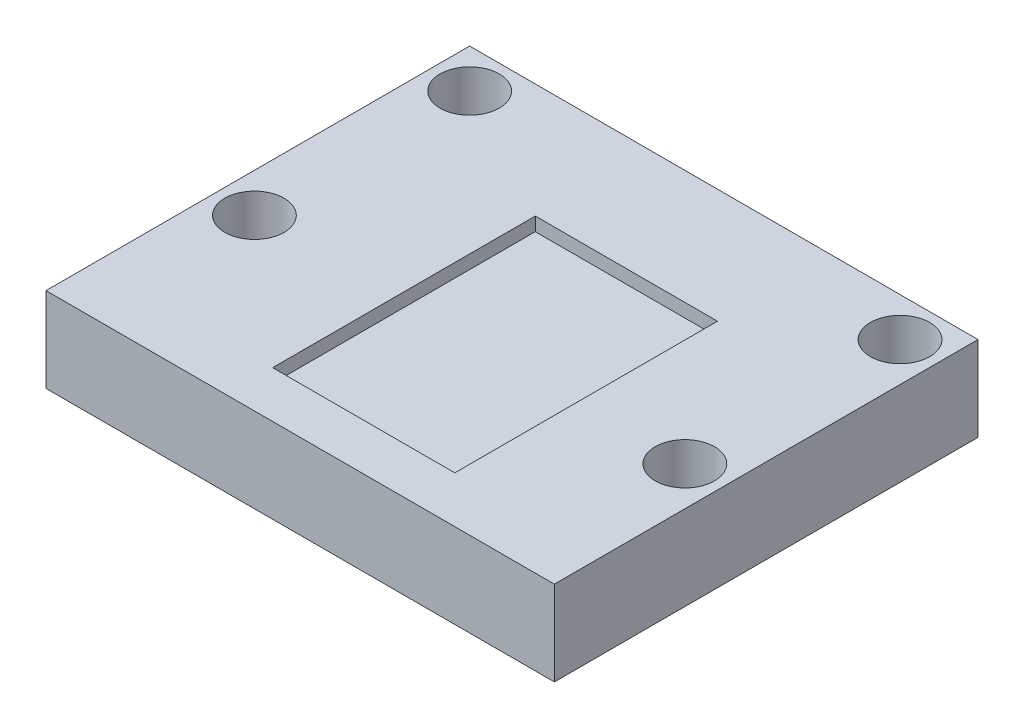
ISO-10303-21;
HEADER;
FILE_DESCRIPTION(('STEP AP214'),'2;1');
FILE_NAME('part.step','',(''),(''),'','','');
FILE_SCHEMA(('AUTOMOTIVE_DESIGN { 1 0 10303 214 1 1 1 1 }'));
ENDSEC;
DATA;
#1=APPLICATION_CONTEXT('core data for automotive mechanical design processes');
#2=APPLICATION_PROTOCOL_DEFINITION('international standard','automotive_design',2000,#1);
#3=PRODUCT_CONTEXT('',#1,'mechanical');
#4=PRODUCT('Part','Part','',(#3));
#5=PRODUCT_RELATED_PRODUCT_CATEGORY('part','',(#4));
#6=PRODUCT_DEFINITION_FORMATION('','',#4);
#7=PRODUCT_DEFINITION_CONTEXT('part definition',#1,'design');
#8=PRODUCT_DEFINITION('design','',#6,#7);
#9=PRODUCT_DEFINITION_SHAPE('','',#8);
#10=(LENGTH_UNIT() NAMED_UNIT(*) SI_UNIT(.MILLI.,.METRE.));
#11=(NAMED_UNIT(*) PLANE_ANGLE_UNIT() SI_UNIT($,.RADIAN.));
#12=(NAMED_UNIT(*) SI_UNIT($,.STERADIAN.) SOLID_ANGLE_UNIT());
#13=UNCERTAINTY_MEASURE_WITH_UNIT(LENGTH_MEASURE(1.E-05),#10,'distance_accuracy_value','');
#14=(GEOMETRIC_REPRESENTATION_CONTEXT(3) GLOBAL_UNCERTAINTY_ASSIGNED_CONTEXT((#13)) GLOBAL_UNIT_ASSIGNED_CONTEXT((#10,
#11,#12)) REPRESENTATION_CONTEXT('',''));
#15=CARTESIAN_POINT('',(0.,0.,0.));
#16=DIRECTION('',(0.,0.,1.));
#17=DIRECTION('',(1.,0.,0.));
#18=AXIS2_PLACEMENT_3D('',#15,#16,#17);
#19=CARTESIAN_POINT('',(0.,10.,0.));
#20=DIRECTION('',(1.,0.,0.));
#21=DIRECTION('',(0.,0.,-1.));
#22=AXIS2_PLACEMENT_3D('',#19,#20,#21);
#23=PLANE('',#22);
#24=DIRECTION('',(0.,0.,1.));
#25=VECTOR('',#24,1.);
#26=CARTESIAN_POINT('',(0.,0.,0.));
#27=LINE('',#26,#25);
#28=CARTESIAN_POINT('',(0.,0.,-50.));
#29=VERTEX_POINT('',#28);
#30=CARTESIAN_POINT('',(0.,0.,0.));
#31=VERTEX_POINT('',#30);
#32=EDGE_CURVE('E200',#29,#31,#27,.T.);
#33=ORIENTED_EDGE('',*,*,#32,.T.);
#34=DIRECTION('',(0.,-1.,0.));
#35=VECTOR('',#34,1.);
#36=CARTESIAN_POINT('',(0.,10.,0.));
#37=LINE('',#36,#35);
#38=CARTESIAN_POINT('',(0.,10.,0.));
#39=VERTEX_POINT('',#38);
#40=EDGE_CURVE('E11',#39,#31,#37,.T.);
#41=ORIENTED_EDGE('',*,*,#40,.F.);
#42=DIRECTION('',(0.,0.,1.));
#43=VECTOR('',#42,1.);
#44=CARTESIAN_POINT('',(0.,10.,0.));
#45=LINE('',#44,#43);
#46=CARTESIAN_POINT('',(0.,10.,-50.));
#47=VERTEX_POINT('',#46);
#48=EDGE_CURVE('E204',#47,#39,#45,.T.);
#49=ORIENTED_EDGE('',*,*,#48,.F.);
#50=DIRECTION('',(0.,-1.,0.));
#51=VECTOR('',#50,1.);
#52=CARTESIAN_POINT('',(0.,10.,-50.));
#53=LINE('',#52,#51);
#54=EDGE_CURVE('E214',#47,#29,#53,.T.);
#55=ORIENTED_EDGE('',*,*,#54,.T.);
#56=EDGE_LOOP('',(#33,#41,#49,#55));
#57=FACE_BOUND('',#56,.T.);
#58=ADVANCED_FACE('F47',(#57),#23,.F.);
#59=CARTESIAN_POINT('',(0.,10.,0.));
#60=DIRECTION('',(0.,0.,-1.));
#61=DIRECTION('',(-1.,0.,0.));
#62=AXIS2_PLACEMENT_3D('',#59,#60,#61);
#63=PLANE('',#62);
#64=DIRECTION('',(1.,0.,0.));
#65=VECTOR('',#64,1.);
#66=CARTESIAN_POINT('',(0.,0.,0.));
#67=LINE('',#66,#65);
#68=CARTESIAN_POINT('',(60.,0.,0.));
#69=VERTEX_POINT('',#68);
#70=EDGE_CURVE('E218',#31,#69,#67,.T.);
#71=ORIENTED_EDGE('',*,*,#70,.T.);
#72=DIRECTION('',(0.,-1.,0.));
#73=VECTOR('',#72,1.);
#74=CARTESIAN_POINT('',(60.,10.,0.));
#75=LINE('',#74,#73);
#76=CARTESIAN_POINT('',(60.,10.,0.));
#77=VERTEX_POINT('',#76);
#78=EDGE_CURVE('E55',#77,#69,#75,.T.);
#79=ORIENTED_EDGE('',*,*,#78,.F.);
#80=DIRECTION('',(1.,0.,0.));
#81=VECTOR('',#80,1.);
#82=CARTESIAN_POINT('',(0.,10.,0.));
#83=LINE('',#82,#81);
#84=EDGE_CURVE('E99',#39,#77,#83,.T.);
#85=ORIENTED_EDGE('',*,*,#84,.F.);
#86=ORIENTED_EDGE('',*,*,#40,.T.);
#87=EDGE_LOOP('',(#71,#79,#85,#86));
#88=FACE_BOUND('',#87,.T.);
#89=ADVANCED_FACE('F254',(#88),#63,.F.);
#90=CARTESIAN_POINT('',(60.,10.,0.));
#91=DIRECTION('',(-1.,0.,0.));
#92=DIRECTION('',(0.,0.,1.));
#93=AXIS2_PLACEMENT_3D('',#90,#91,#92);
#94=PLANE('',#93);
#95=DIRECTION('',(0.,0.,-1.));
#96=VECTOR('',#95,1.);
#97=CARTESIAN_POINT('',(60.,0.,0.));
#98=LINE('',#97,#96);
#99=CARTESIAN_POINT('',(60.,0.,-50.));
#100=VERTEX_POINT('',#99);
#101=EDGE_CURVE('E221',#69,#100,#98,.T.);
#102=ORIENTED_EDGE('',*,*,#101,.T.);
#103=DIRECTION('',(0.,-1.,0.));
#104=VECTOR('',#103,1.);
#105=CARTESIAN_POINT('',(60.,10.,-50.));
#106=LINE('',#105,#104);
#107=CARTESIAN_POINT('',(60.,10.,-50.));
#108=VERTEX_POINT('',#107);
#109=EDGE_CURVE('E228',#108,#100,#106,.T.);
#110=ORIENTED_EDGE('',*,*,#109,.F.);
#111=DIRECTION('',(0.,0.,-1.));
#112=VECTOR('',#111,1.);
#113=CARTESIAN_POINT('',(60.,10.,0.));
#114=LINE('',#113,#112);
#115=EDGE_CURVE('E209',#77,#108,#114,.T.);
#116=ORIENTED_EDGE('',*,*,#115,.F.);
#117=ORIENTED_EDGE('',*,*,#78,.T.);
#118=EDGE_LOOP('',(#102,#110,#116,#117));
#119=FACE_BOUND('',#118,.T.);
#120=ADVANCED_FACE('F235',(#119),#94,.F.);
#121=CARTESIAN_POINT('',(0.,10.,-50.));
#122=DIRECTION('',(0.,0.,1.));
#123=DIRECTION('',(1.,0.,0.));
#124=AXIS2_PLACEMENT_3D('',#121,#122,#123);
#125=PLANE('',#124);
#126=DIRECTION('',(-1.,0.,0.));
#127=VECTOR('',#126,1.);
#128=CARTESIAN_POINT('',(0.,0.,-50.));
#129=LINE('',#128,#127);
#130=EDGE_CURVE('E92',#100,#29,#129,.T.);
#131=ORIENTED_EDGE('',*,*,#130,.T.);
#132=ORIENTED_EDGE('',*,*,#54,.F.);
#133=DIRECTION('',(-1.,0.,0.));
#134=VECTOR('',#133,1.);
#135=CARTESIAN_POINT('',(0.,10.,-50.));
#136=LINE('',#135,#134);
#137=EDGE_CURVE('E71',#108,#47,#136,.T.);
#138=ORIENTED_EDGE('',*,*,#137,.F.);
#139=ORIENTED_EDGE('',*,*,#109,.T.);
#140=EDGE_LOOP('',(#131,#132,#138,#139));
#141=FACE_BOUND('',#140,.T.);
#142=ADVANCED_FACE('F243',(#141),#125,.F.);
#143=CARTESIAN_POINT('',(0.,10.,0.));
#144=DIRECTION('',(0.,-1.,0.));
#145=DIRECTION('',(0.,0.,-1.));
#146=AXIS2_PLACEMENT_3D('',#143,#144,#145);
#147=PLANE('',#146);
#148=DIRECTION('',(1.,0.,0.));
#149=VECTOR('',#148,1.);
#150=CARTESIAN_POINT('',(21.25,10.,-5.50000000000002));
#151=LINE('',#150,#149);
#152=CARTESIAN_POINT('',(21.25,10.,-5.50000000000002));
#153=VERTEX_POINT('',#152);
#154=CARTESIAN_POINT('',(42.75,10.,-5.50000000000001));
#155=VERTEX_POINT('',#154);
#156=EDGE_CURVE('E157',#153,#155,#151,.T.);
#157=ORIENTED_EDGE('',*,*,#156,.F.);
#158=DIRECTION('',(0.,0.,1.));
#159=VECTOR('',#158,1.);
#160=CARTESIAN_POINT('',(21.25,10.,-36.5));
#161=LINE('',#160,#159);
#162=CARTESIAN_POINT('',(21.25,10.,-36.5));
#163=VERTEX_POINT('',#162);
#164=EDGE_CURVE('E62',#163,#153,#161,.T.);
#165=ORIENTED_EDGE('',*,*,#164,.F.);
#166=DIRECTION('',(-1.,0.,0.));
#167=VECTOR('',#166,1.);
#168=CARTESIAN_POINT('',(21.25,10.,-36.5));
#169=LINE('',#168,#167);
#170=CARTESIAN_POINT('',(42.75,10.,-36.5));
#171=VERTEX_POINT('',#170);
#172=EDGE_CURVE('E144',#171,#163,#169,.T.);
#173=ORIENTED_EDGE('',*,*,#172,.F.);
#174=DIRECTION('',(0.,0.,-1.));
#175=VECTOR('',#174,1.);
#176=CARTESIAN_POINT('',(42.75,10.,-36.5));
#177=LINE('',#176,#175);
#178=EDGE_CURVE('E148',#155,#171,#177,.T.);
#179=ORIENTED_EDGE('',*,*,#178,.F.);
#180=EDGE_LOOP('',(#157,#165,#173,#179));
#181=FACE_BOUND('',#180,.T.);
#182=CARTESIAN_POINT('',(55.4,10.,-45.4));
#183=DIRECTION('',(0.,1.,0.));
#184=DIRECTION('',(0.,0.,1.));
#185=AXIS2_PLACEMENT_3D('',#182,#183,#184);
#186=CIRCLE('',#185,3.5);
#187=CARTESIAN_POINT('',(55.4,10.,-41.9));
#188=VERTEX_POINT('',#187);
#189=EDGE_CURVE('E185',#188,#188,#186,.T.);
#190=ORIENTED_EDGE('',*,*,#189,.F.);
#191=EDGE_LOOP('',(#190));
#192=FACE_BOUND('',#191,.T.);
#193=CARTESIAN_POINT('',(4.6,10.,-20.));
#194=DIRECTION('',(0.,1.,0.));
#195=DIRECTION('',(0.,0.,1.));
#196=AXIS2_PLACEMENT_3D('',#193,#194,#195);
#197=CIRCLE('',#196,3.5);
#198=CARTESIAN_POINT('',(4.6,10.,-16.5));
#199=VERTEX_POINT('',#198);
#200=EDGE_CURVE('E176',#199,#199,#197,.T.);
#201=ORIENTED_EDGE('',*,*,#200,.F.);
#202=EDGE_LOOP('',(#201));
#203=FACE_BOUND('',#202,.T.);
#204=CARTESIAN_POINT('',(55.4,10.,-20.));
#205=DIRECTION('',(0.,1.,0.));
#206=DIRECTION('',(0.,0.,1.));
#207=AXIS2_PLACEMENT_3D('',#204,#205,#206);
#208=CIRCLE('',#207,3.5);
#209=CARTESIAN_POINT('',(55.4,10.,-16.5));
#210=VERTEX_POINT('',#209);
#211=EDGE_CURVE('E166',#210,#210,#208,.T.);
#212=ORIENTED_EDGE('',*,*,#211,.F.);
#213=EDGE_LOOP('',(#212));
#214=FACE_BOUND('',#213,.T.);
#215=CARTESIAN_POINT('',(4.6,10.,-45.4));
#216=DIRECTION('',(0.,1.,0.));
#217=DIRECTION('',(0.,0.,1.));
#218=AXIS2_PLACEMENT_3D('',#215,#216,#217);
#219=CIRCLE('',#218,3.50000000000001);
#220=CARTESIAN_POINT('',(4.6,10.,-41.9));
#221=VERTEX_POINT('',#220);
#222=EDGE_CURVE('E184',#221,#221,#219,.T.);
#223=ORIENTED_EDGE('',*,*,#222,.F.);
#224=EDGE_LOOP('',(#223));
#225=FACE_BOUND('',#224,.T.);
#226=ORIENTED_EDGE('',*,*,#48,.T.);
#227=ORIENTED_EDGE('',*,*,#84,.T.);
#228=ORIENTED_EDGE('',*,*,#115,.T.);
#229=ORIENTED_EDGE('',*,*,#137,.T.);
#230=EDGE_LOOP('',(#226,#227,#228,#229));
#231=FACE_BOUND('',#230,.T.);
#232=ADVANCED_FACE('F245',(#181,#192,#203,#214,#225,#231),#147,.F.);
#233=CARTESIAN_POINT('',(0.,0.,0.));
#234=DIRECTION('',(0.,-1.,0.));
#235=DIRECTION('',(0.,0.,-1.));
#236=AXIS2_PLACEMENT_3D('',#233,#234,#235);
#237=PLANE('',#236);
#238=CARTESIAN_POINT('',(55.4,0.,-45.4));
#239=DIRECTION('',(0.,1.,0.));
#240=DIRECTION('',(0.,0.,1.));
#241=AXIS2_PLACEMENT_3D('',#238,#239,#240);
#242=CIRCLE('',#241,3.5);
#243=CARTESIAN_POINT('',(55.4,0.,-41.9));
#244=VERTEX_POINT('',#243);
#245=EDGE_CURVE('E180',#244,#244,#242,.T.);
#246=ORIENTED_EDGE('',*,*,#245,.T.);
#247=EDGE_LOOP('',(#246));
#248=FACE_BOUND('',#247,.T.);
#249=CARTESIAN_POINT('',(4.6,0.,-20.));
#250=DIRECTION('',(0.,1.,0.));
#251=DIRECTION('',(0.,0.,1.));
#252=AXIS2_PLACEMENT_3D('',#249,#250,#251);
#253=CIRCLE('',#252,3.5);
#254=CARTESIAN_POINT('',(4.6,0.,-16.5));
#255=VERTEX_POINT('',#254);
#256=EDGE_CURVE('E189',#255,#255,#253,.T.);
#257=ORIENTED_EDGE('',*,*,#256,.T.);
#258=EDGE_LOOP('',(#257));
#259=FACE_BOUND('',#258,.T.);
#260=CARTESIAN_POINT('',(55.4,0.,-20.));
#261=DIRECTION('',(0.,1.,0.));
#262=DIRECTION('',(0.,0.,1.));
#263=AXIS2_PLACEMENT_3D('',#260,#261,#262);
#264=CIRCLE('',#263,3.5);
#265=CARTESIAN_POINT('',(55.4,0.,-16.5));
#266=VERTEX_POINT('',#265);
#267=EDGE_CURVE('E172',#266,#266,#264,.T.);
#268=ORIENTED_EDGE('',*,*,#267,.T.);
#269=EDGE_LOOP('',(#268));
#270=FACE_BOUND('',#269,.T.);
#271=CARTESIAN_POINT('',(4.6,0.,-45.4));
#272=DIRECTION('',(0.,1.,0.));
#273=DIRECTION('',(0.,0.,1.));
#274=AXIS2_PLACEMENT_3D('',#271,#272,#273);
#275=CIRCLE('',#274,3.50000000000001);
#276=CARTESIAN_POINT('',(4.6,0.,-41.9));
#277=VERTEX_POINT('',#276);
#278=EDGE_CURVE('E196',#277,#277,#275,.T.);
#279=ORIENTED_EDGE('',*,*,#278,.T.);
#280=EDGE_LOOP('',(#279));
#281=FACE_BOUND('',#280,.T.);
#282=ORIENTED_EDGE('',*,*,#32,.F.);
#283=ORIENTED_EDGE('',*,*,#130,.F.);
#284=ORIENTED_EDGE('',*,*,#101,.F.);
#285=ORIENTED_EDGE('',*,*,#70,.F.);
#286=EDGE_LOOP('',(#282,#283,#284,#285));
#287=FACE_BOUND('',#286,.T.);
#288=ADVANCED_FACE('F239',(#248,#259,#270,#281,#287),#237,.T.);
#289=CARTESIAN_POINT('',(4.6,0.,-45.4));
#290=DIRECTION('',(0.,1.,0.));
#291=DIRECTION('',(0.,0.,1.));
#292=AXIS2_PLACEMENT_3D('',#289,#290,#291);
#293=CYLINDRICAL_SURFACE('',#292,3.50000000000001);
#294=ORIENTED_EDGE('',*,*,#278,.F.);
#295=EDGE_LOOP('',(#294));
#296=FACE_BOUND('',#295,.T.);
#297=ORIENTED_EDGE('',*,*,#222,.T.);
#298=EDGE_LOOP('',(#297));
#299=FACE_BOUND('',#298,.T.);
#300=ADVANCED_FACE('F289',(#296,#299),#293,.F.);
#301=CARTESIAN_POINT('',(55.4,0.,-20.));
#302=DIRECTION('',(0.,1.,0.));
#303=DIRECTION('',(0.,0.,1.));
#304=AXIS2_PLACEMENT_3D('',#301,#302,#303);
#305=CYLINDRICAL_SURFACE('',#304,3.5);
#306=ORIENTED_EDGE('',*,*,#267,.F.);
#307=EDGE_LOOP('',(#306));
#308=FACE_BOUND('',#307,.T.);
#309=ORIENTED_EDGE('',*,*,#211,.T.);
#310=EDGE_LOOP('',(#309));
#311=FACE_BOUND('',#310,.T.);
#312=ADVANCED_FACE('F298',(#308,#311),#305,.F.);
#313=CARTESIAN_POINT('',(4.6,0.,-20.));
#314=DIRECTION('',(0.,1.,0.));
#315=DIRECTION('',(0.,0.,1.));
#316=AXIS2_PLACEMENT_3D('',#313,#314,#315);
#317=CYLINDRICAL_SURFACE('',#316,3.5);
#318=ORIENTED_EDGE('',*,*,#256,.F.);
#319=EDGE_LOOP('',(#318));
#320=FACE_BOUND('',#319,.T.);
#321=ORIENTED_EDGE('',*,*,#200,.T.);
#322=EDGE_LOOP('',(#321));
#323=FACE_BOUND('',#322,.T.);
#324=ADVANCED_FACE('F308',(#320,#323),#317,.F.);
#325=CARTESIAN_POINT('',(55.4,0.,-45.4));
#326=DIRECTION('',(0.,1.,0.));
#327=DIRECTION('',(0.,0.,1.));
#328=AXIS2_PLACEMENT_3D('',#325,#326,#327);
#329=CYLINDRICAL_SURFACE('',#328,3.5);
#330=ORIENTED_EDGE('',*,*,#245,.F.);
#331=EDGE_LOOP('',(#330));
#332=FACE_BOUND('',#331,.T.);
#333=ORIENTED_EDGE('',*,*,#189,.T.);
#334=EDGE_LOOP('',(#333));
#335=FACE_BOUND('',#334,.T.);
#336=ADVANCED_FACE('F318',(#332,#335),#329,.F.);
#337=CARTESIAN_POINT('',(21.25,8.4,-36.5));
#338=DIRECTION('',(-1.,0.,0.));
#339=DIRECTION('',(0.,0.,1.));
#340=AXIS2_PLACEMENT_3D('',#337,#338,#339);
#341=PLANE('',#340);
#342=ORIENTED_EDGE('',*,*,#164,.T.);
#343=DIRECTION('',(0.,1.,0.));
#344=VECTOR('',#343,1.);
#345=CARTESIAN_POINT('',(21.25,8.4,-5.50000000000002));
#346=LINE('',#345,#344);
#347=CARTESIAN_POINT('',(21.25,8.4,-5.50000000000002));
#348=VERTEX_POINT('',#347);
#349=EDGE_CURVE('E119',#348,#153,#346,.T.);
#350=ORIENTED_EDGE('',*,*,#349,.F.);
#351=DIRECTION('',(0.,0.,1.));
#352=VECTOR('',#351,1.);
#353=CARTESIAN_POINT('',(21.25,8.4,-36.5));
#354=LINE('',#353,#352);
#355=CARTESIAN_POINT('',(21.25,8.4,-36.5));
#356=VERTEX_POINT('',#355);
#357=EDGE_CURVE('E123',#356,#348,#354,.T.);
#358=ORIENTED_EDGE('',*,*,#357,.F.);
#359=DIRECTION('',(0.,1.,0.));
#360=VECTOR('',#359,1.);
#361=CARTESIAN_POINT('',(21.25,8.4,-36.5));
#362=LINE('',#361,#360);
#363=EDGE_CURVE('E163',#356,#163,#362,.T.);
#364=ORIENTED_EDGE('',*,*,#363,.T.);
#365=EDGE_LOOP('',(#342,#350,#358,#364));
#366=FACE_BOUND('',#365,.T.);
#367=ADVANCED_FACE('F121',(#366),#341,.F.);
#368=CARTESIAN_POINT('',(21.25,8.4,-36.5));
#369=DIRECTION('',(0.,0.,-1.));
#370=DIRECTION('',(-1.,0.,0.));
#371=AXIS2_PLACEMENT_3D('',#368,#369,#370);
#372=PLANE('',#371);
#373=ORIENTED_EDGE('',*,*,#172,.T.);
#374=ORIENTED_EDGE('',*,*,#363,.F.);
#375=DIRECTION('',(-1.,0.,0.));
#376=VECTOR('',#375,1.);
#377=CARTESIAN_POINT('',(21.25,8.4,-36.5));
#378=LINE('',#377,#376);
#379=CARTESIAN_POINT('',(42.75,8.4,-36.5));
#380=VERTEX_POINT('',#379);
#381=EDGE_CURVE('E130',#380,#356,#378,.T.);
#382=ORIENTED_EDGE('',*,*,#381,.F.);
#383=DIRECTION('',(0.,1.,0.));
#384=VECTOR('',#383,1.);
#385=CARTESIAN_POINT('',(42.75,8.4,-36.5));
#386=LINE('',#385,#384);
#387=EDGE_CURVE('E167',#380,#171,#386,.T.);
#388=ORIENTED_EDGE('',*,*,#387,.T.);
#389=EDGE_LOOP('',(#373,#374,#382,#388));
#390=FACE_BOUND('',#389,.T.);
#391=ADVANCED_FACE('F335',(#390),#372,.F.);
#392=CARTESIAN_POINT('',(42.75,8.4,-36.5));
#393=DIRECTION('',(1.,0.,0.));
#394=DIRECTION('',(0.,0.,-1.));
#395=AXIS2_PLACEMENT_3D('',#392,#393,#394);
#396=PLANE('',#395);
#397=ORIENTED_EDGE('',*,*,#178,.T.);
#398=ORIENTED_EDGE('',*,*,#387,.F.);
#399=DIRECTION('',(0.,0.,-1.));
#400=VECTOR('',#399,1.);
#401=CARTESIAN_POINT('',(42.75,8.4,-36.5));
#402=LINE('',#401,#400);
#403=CARTESIAN_POINT('',(42.75,8.4,-5.50000000000001));
#404=VERTEX_POINT('',#403);
#405=EDGE_CURVE('E139',#404,#380,#402,.T.);
#406=ORIENTED_EDGE('',*,*,#405,.F.);
#407=DIRECTION('',(0.,1.,0.));
#408=VECTOR('',#407,1.);
#409=CARTESIAN_POINT('',(42.75,8.4,-5.50000000000001));
#410=LINE('',#409,#408);
#411=EDGE_CURVE('E129',#404,#155,#410,.T.);
#412=ORIENTED_EDGE('',*,*,#411,.T.);
#413=EDGE_LOOP('',(#397,#398,#406,#412));
#414=FACE_BOUND('',#413,.T.);
#415=ADVANCED_FACE('F344',(#414),#396,.F.);
#416=CARTESIAN_POINT('',(21.25,8.4,-5.50000000000002));
#417=DIRECTION('',(0.,0.,1.));
#418=DIRECTION('',(1.,0.,0.));
#419=AXIS2_PLACEMENT_3D('',#416,#417,#418);
#420=PLANE('',#419);
#421=ORIENTED_EDGE('',*,*,#156,.T.);
#422=ORIENTED_EDGE('',*,*,#411,.F.);
#423=DIRECTION('',(1.,0.,0.));
#424=VECTOR('',#423,1.);
#425=CARTESIAN_POINT('',(21.25,8.4,-5.50000000000002));
#426=LINE('',#425,#424);
#427=EDGE_CURVE('E133',#348,#404,#426,.T.);
#428=ORIENTED_EDGE('',*,*,#427,.F.);
#429=ORIENTED_EDGE('',*,*,#349,.T.);
#430=EDGE_LOOP('',(#421,#422,#428,#429));
#431=FACE_BOUND('',#430,.T.);
#432=ADVANCED_FACE('F134',(#431),#420,.F.);
#433=CARTESIAN_POINT('',(0.,8.4,0.));
#434=DIRECTION('',(0.,1.,0.));
#435=DIRECTION('',(0.,0.,1.));
#436=AXIS2_PLACEMENT_3D('',#433,#434,#435);
#437=PLANE('',#436);
#438=ORIENTED_EDGE('',*,*,#357,.T.);
#439=ORIENTED_EDGE('',*,*,#427,.T.);
#440=ORIENTED_EDGE('',*,*,#405,.T.);
#441=ORIENTED_EDGE('',*,*,#381,.T.);
#442=EDGE_LOOP('',(#438,#439,#440,#441));
#443=FACE_BOUND('',#442,.T.);
#444=ADVANCED_FACE('F141',(#443),#437,.T.);
#445=CLOSED_SHELL('',(#58,#89,#120,#142,#232,#288,#300,#312,#324,#336,#367,#391,#415,#432,#444));
#446=MANIFOLD_SOLID_BREP('B2',#445);
#447=ADVANCED_BREP_SHAPE_REPRESENTATION('',(#18,#446),#14);
#448=SHAPE_DEFINITION_REPRESENTATION(#9,#447);
ENDSEC;
END-ISO-10303-21;
